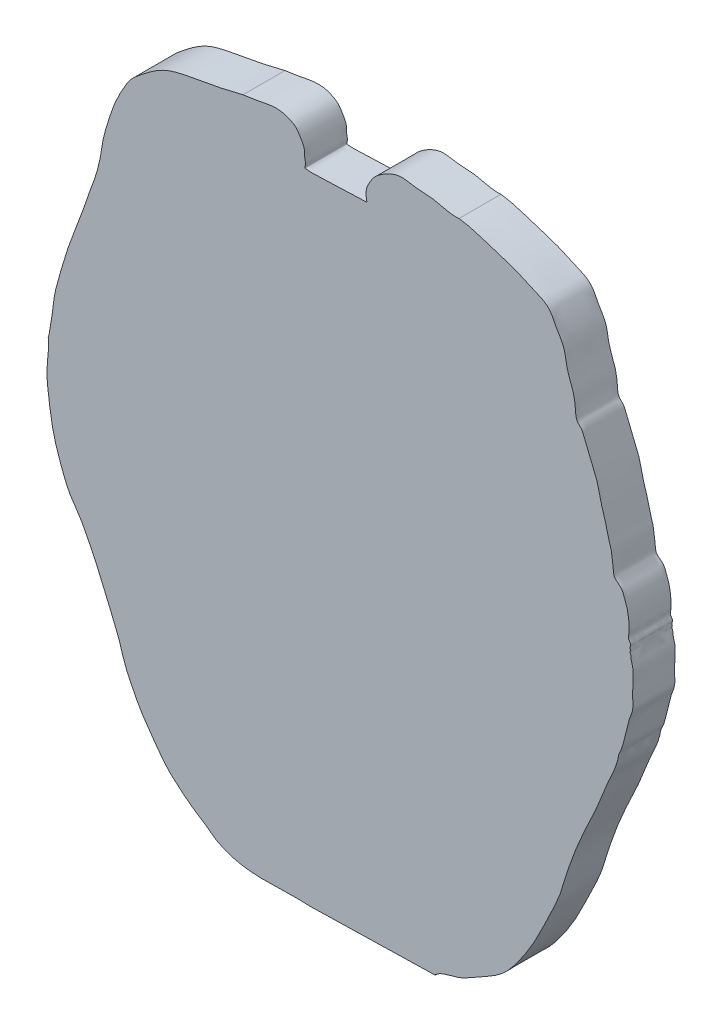
ISO-10303-21;
HEADER;
FILE_DESCRIPTION(('STEP AP214'),'2;1');
FILE_NAME('part.step','',(''),(''),'','','');
FILE_SCHEMA(('AUTOMOTIVE_DESIGN { 1 0 10303 214 1 1 1 1 }'));
ENDSEC;
DATA;
#1=APPLICATION_CONTEXT('core data for automotive mechanical design processes');
#2=APPLICATION_PROTOCOL_DEFINITION('international standard','automotive_design',2000,#1);
#3=PRODUCT_CONTEXT('',#1,'mechanical');
#4=PRODUCT('Part','Part','',(#3));
#5=PRODUCT_RELATED_PRODUCT_CATEGORY('part','',(#4));
#6=PRODUCT_DEFINITION_FORMATION('','',#4);
#7=PRODUCT_DEFINITION_CONTEXT('part definition',#1,'design');
#8=PRODUCT_DEFINITION('design','',#6,#7);
#9=PRODUCT_DEFINITION_SHAPE('','',#8);
#10=(LENGTH_UNIT() NAMED_UNIT(*) SI_UNIT(.MILLI.,.METRE.));
#11=(NAMED_UNIT(*) PLANE_ANGLE_UNIT() SI_UNIT($,.RADIAN.));
#12=(NAMED_UNIT(*) SI_UNIT($,.STERADIAN.) SOLID_ANGLE_UNIT());
#13=UNCERTAINTY_MEASURE_WITH_UNIT(LENGTH_MEASURE(1.E-05),#10,'distance_accuracy_value','');
#14=(GEOMETRIC_REPRESENTATION_CONTEXT(3) GLOBAL_UNCERTAINTY_ASSIGNED_CONTEXT((#13)) GLOBAL_UNIT_ASSIGNED_CONTEXT((#10,
#11,#12)) REPRESENTATION_CONTEXT('',''));
#15=CARTESIAN_POINT('',(0.,0.,0.));
#16=DIRECTION('',(0.,0.,1.));
#17=DIRECTION('',(1.,0.,0.));
#18=AXIS2_PLACEMENT_3D('',#15,#16,#17);
#19=CARTESIAN_POINT('',(-1067.80244217999,-595.323122818989,100.));
#20=CARTESIAN_POINT('',(-997.118302992686,-634.980800497117,100.));
#21=CARTESIAN_POINT('',(-919.007086081671,-615.388320093955,100.));
#22=CARTESIAN_POINT('',(-843.99446333732,-620.515143976318,100.));
#23=B_SPLINE_CURVE_WITH_KNOTS('',3,(#19,#20,#21,#22),.UNSPECIFIED.,.F.,.F.,(4,4),(0.,1.),.UNSPECIFIED.);
#24=DIRECTION('',(0.,0.,-1.));
#25=VECTOR('',#24,1.);
#26=SURFACE_OF_LINEAR_EXTRUSION('',#23,#25);
#27=CARTESIAN_POINT('',(-1067.80244217999,-595.323122818989,0.));
#28=CARTESIAN_POINT('',(-997.118302992686,-634.980800497117,0.));
#29=CARTESIAN_POINT('',(-919.007086081671,-615.388320093955,0.));
#30=CARTESIAN_POINT('',(-843.99446333732,-620.515143976318,0.));
#31=B_SPLINE_CURVE_WITH_KNOTS('',3,(#27,#28,#29,#30),.UNSPECIFIED.,.F.,.F.,(4,4),(0.,1.),.UNSPECIFIED.);
#32=CARTESIAN_POINT('',(-1067.80244217999,-595.323122818989,0.));
#33=VERTEX_POINT('',#32);
#34=CARTESIAN_POINT('',(-843.99446333732,-620.515143976318,0.));
#35=VERTEX_POINT('',#34);
#36=EDGE_CURVE('E220',#33,#35,#31,.T.);
#37=ORIENTED_EDGE('',*,*,#36,.T.);
#38=DIRECTION('',(0.,0.,-1.));
#39=VECTOR('',#38,1.);
#40=CARTESIAN_POINT('',(-843.99446333732,-620.515143976318,100.));
#41=LINE('',#40,#39);
#42=CARTESIAN_POINT('',(-843.99446333732,-620.515143976318,100.));
#43=VERTEX_POINT('',#42);
#44=EDGE_CURVE('E11',#43,#35,#41,.T.);
#45=ORIENTED_EDGE('',*,*,#44,.F.);
#46=CARTESIAN_POINT('',(-1067.80244217999,-595.323122818989,100.));
#47=VERTEX_POINT('',#46);
#48=EDGE_CURVE('E93',#47,#43,#23,.T.);
#49=ORIENTED_EDGE('',*,*,#48,.F.);
#50=DIRECTION('',(0.,0.,-1.));
#51=VECTOR('',#50,1.);
#52=CARTESIAN_POINT('',(-1067.80244217999,-595.323122818989,100.));
#53=LINE('',#52,#51);
#54=EDGE_CURVE('E56',#47,#33,#53,.T.);
#55=ORIENTED_EDGE('',*,*,#54,.T.);
#56=EDGE_LOOP('',(#37,#45,#49,#55));
#57=FACE_BOUND('',#56,.T.);
#58=ADVANCED_FACE('F39',(#57),#26,.F.);
#59=CARTESIAN_POINT('',(-544.99446333732,-613.515143976318,100.));
#60=DIRECTION('',(0.0234049580773987,-0.999726066448902,0.));
#61=DIRECTION('',(0.999726066448902,0.0234049580773987,0.));
#62=AXIS2_PLACEMENT_3D('',#59,#60,#61);
#63=PLANE('',#62);
#64=DIRECTION('',(-0.999726066448902,-0.0234049580773987,0.));
#65=VECTOR('',#64,1.);
#66=CARTESIAN_POINT('',(-544.99446333732,-613.515143976318,0.));
#67=LINE('',#66,#65);
#68=CARTESIAN_POINT('',(-544.99446333732,-613.515143976318,0.));
#69=VERTEX_POINT('',#68);
#70=EDGE_CURVE('E218',#69,#35,#67,.T.);
#71=ORIENTED_EDGE('',*,*,#70,.F.);
#72=DIRECTION('',(0.,0.,-1.));
#73=VECTOR('',#72,1.);
#74=CARTESIAN_POINT('',(-544.99446333732,-613.515143976318,100.));
#75=LINE('',#74,#73);
#76=CARTESIAN_POINT('',(-544.99446333732,-613.515143976318,100.));
#77=VERTEX_POINT('',#76);
#78=EDGE_CURVE('E48',#77,#69,#75,.T.);
#79=ORIENTED_EDGE('',*,*,#78,.F.);
#80=DIRECTION('',(-0.999726066448902,-0.0234049580773987,0.));
#81=VECTOR('',#80,1.);
#82=CARTESIAN_POINT('',(-544.99446333732,-613.515143976318,100.));
#83=LINE('',#82,#81);
#84=EDGE_CURVE('E179',#77,#43,#83,.T.);
#85=ORIENTED_EDGE('',*,*,#84,.T.);
#86=ORIENTED_EDGE('',*,*,#44,.T.);
#87=EDGE_LOOP('',(#71,#79,#85,#86));
#88=FACE_BOUND('',#87,.T.);
#89=ADVANCED_FACE('F219',(#88),#63,.T.);
#90=CARTESIAN_POINT('',(-544.99446333732,-612.515143976318,100.));
#91=DIRECTION('',(1.,0.,0.));
#92=DIRECTION('',(0.,0.,-1.));
#93=AXIS2_PLACEMENT_3D('',#90,#91,#92);
#94=PLANE('',#93);
#95=DIRECTION('',(0.,-1.,0.));
#96=VECTOR('',#95,1.);
#97=CARTESIAN_POINT('',(-544.99446333732,-612.515143976318,0.));
#98=LINE('',#97,#96);
#99=CARTESIAN_POINT('',(-544.99446333732,-612.515143976318,0.));
#100=VERTEX_POINT('',#99);
#101=EDGE_CURVE('E213',#100,#69,#98,.T.);
#102=ORIENTED_EDGE('',*,*,#101,.F.);
#103=DIRECTION('',(0.,0.,-1.));
#104=VECTOR('',#103,1.);
#105=CARTESIAN_POINT('',(-544.99446333732,-612.515143976318,100.));
#106=LINE('',#105,#104);
#107=CARTESIAN_POINT('',(-544.99446333732,-612.515143976318,100.));
#108=VERTEX_POINT('',#107);
#109=EDGE_CURVE('E207',#108,#100,#106,.T.);
#110=ORIENTED_EDGE('',*,*,#109,.F.);
#111=DIRECTION('',(0.,-1.,0.));
#112=VECTOR('',#111,1.);
#113=CARTESIAN_POINT('',(-544.99446333732,-612.515143976318,100.));
#114=LINE('',#113,#112);
#115=EDGE_CURVE('E173',#108,#77,#114,.T.);
#116=ORIENTED_EDGE('',*,*,#115,.T.);
#117=ORIENTED_EDGE('',*,*,#78,.T.);
#118=EDGE_LOOP('',(#102,#110,#116,#117));
#119=FACE_BOUND('',#118,.T.);
#120=ADVANCED_FACE('F211',(#119),#94,.T.);
#121=CARTESIAN_POINT('',(-488.174265843598,977.704076621266,100.));
#122=CARTESIAN_POINT('',(-456.27669842423,973.772819568264,100.));
#123=CARTESIAN_POINT('',(-413.082050901761,956.001393340243,100.));
#124=CARTESIAN_POINT('',(-352.88053777627,940.042979017114,100.));
#125=CARTESIAN_POINT('',(-315.670408772491,920.096845698454,100.));
#126=CARTESIAN_POINT('',(-282.638450263019,909.115656445168,100.));
#127=CARTESIAN_POINT('',(-266.103267678689,889.158083790079,100.));
#128=CARTESIAN_POINT('',(-255.626909848488,864.830458521624,100.));
#129=CARTESIAN_POINT('',(-234.906704645958,837.488931337633,100.));
#130=CARTESIAN_POINT('',(-232.912182322015,797.596000168427,100.));
#131=CARTESIAN_POINT('',(-216.805122626724,762.645190053665,100.));
#132=CARTESIAN_POINT('',(-210.051739344062,729.655910291816,100.));
#133=CARTESIAN_POINT('',(-210.48683472108,699.650404741302,100.));
#134=CARTESIAN_POINT('',(-195.473367160149,689.870798640654,100.));
#135=CARTESIAN_POINT('',(-190.356917308427,675.569305079209,100.));
#136=CARTESIAN_POINT('',(-183.236172500652,660.113219275418,100.));
#137=CARTESIAN_POINT('',(-175.670732080578,641.069479696946,100.));
#138=CARTESIAN_POINT('',(-169.301082891948,624.944272330599,100.));
#139=CARTESIAN_POINT('',(-160.940778666841,606.918509189212,100.));
#140=CARTESIAN_POINT('',(-155.220160250621,586.954996914519,100.));
#141=CARTESIAN_POINT('',(-150.771527302008,563.520719903201,100.));
#142=CARTESIAN_POINT('',(-144.526324465802,542.958930791993,100.));
#143=CARTESIAN_POINT('',(-137.322376344794,520.688253704635,100.));
#144=CARTESIAN_POINT('',(-133.492446010414,498.07241121497,100.));
#145=CARTESIAN_POINT('',(-124.168210292981,475.49511544781,100.));
#146=CARTESIAN_POINT('',(-123.593395618875,456.007770616522,100.));
#147=CARTESIAN_POINT('',(-119.600202311964,438.31578058616,100.));
#148=CARTESIAN_POINT('',(-120.67770147664,423.113128801113,100.));
#149=CARTESIAN_POINT('',(-108.96382765925,414.077110511738,100.));
#150=CARTESIAN_POINT('',(-99.4283142746941,406.758279522538,100.));
#151=CARTESIAN_POINT('',(-95.0923061044222,394.959107278975,100.));
#152=CARTESIAN_POINT('',(-90.6927061242956,383.673283845476,100.));
#153=CARTESIAN_POINT('',(-86.9680342695029,372.644834332399,100.));
#154=CARTESIAN_POINT('',(-85.0294137033156,361.089359505023,100.));
#155=CARTESIAN_POINT('',(-83.0675792225179,348.96060619307,100.));
#156=CARTESIAN_POINT('',(-83.1328333630723,337.646119685937,100.));
#157=CARTESIAN_POINT('',(-81.4046748803664,324.462048367177,100.));
#158=CARTESIAN_POINT('',(-87.1355160715851,311.967656037185,100.));
#159=CARTESIAN_POINT('',(-77.0075289452424,302.896484143079,100.));
#160=CARTESIAN_POINT('',(-81.4511755585683,296.340032763018,100.));
#161=CARTESIAN_POINT('',(-78.9922922552459,290.912569240715,100.));
#162=CARTESIAN_POINT('',(-81.1248450364348,285.382673090059,100.));
#163=CARTESIAN_POINT('',(-77.8509595576318,280.395040720108,100.));
#164=CARTESIAN_POINT('',(-78.2827920334625,272.538915116393,100.));
#165=CARTESIAN_POINT('',(-75.6949430868123,264.142711362777,100.));
#166=CARTESIAN_POINT('',(-72.8991335284579,253.136627469019,100.));
#167=CARTESIAN_POINT('',(-73.3456039791067,242.437648975268,100.));
#168=CARTESIAN_POINT('',(-72.9360697435838,230.519188130367,100.));
#169=CARTESIAN_POINT('',(-74.2578776331057,218.8955078796,100.));
#170=CARTESIAN_POINT('',(-73.6736192913409,207.232098076885,100.));
#171=CARTESIAN_POINT('',(-74.8004356424112,194.066808289263,100.));
#172=CARTESIAN_POINT('',(-72.6711275018345,179.444613631175,100.));
#173=CARTESIAN_POINT('',(-75.2936155752254,163.050653013267,100.));
#174=CARTESIAN_POINT('',(-81.8809330584591,149.176288447222,100.));
#175=CARTESIAN_POINT('',(-87.2228903750647,126.097374784738,100.));
#176=CARTESIAN_POINT('',(-93.8043306644634,101.137095726614,100.));
#177=CARTESIAN_POINT('',(-100.061347868966,75.1626308217554,100.));
#178=CARTESIAN_POINT('',(-107.882675617774,61.8619277686332,100.));
#179=CARTESIAN_POINT('',(-108.797051732633,51.7138459543968,100.));
#180=CARTESIAN_POINT('',(-111.518705333155,42.3424245704491,100.));
#181=CARTESIAN_POINT('',(-115.227974272958,30.3905840414519,100.));
#182=CARTESIAN_POINT('',(-120.928179416441,16.5564058371068,100.));
#183=CARTESIAN_POINT('',(-131.704513669928,-4.95594493607238,100.));
#184=CARTESIAN_POINT('',(-143.438372488137,-34.3116614398319,100.));
#185=CARTESIAN_POINT('',(-156.513526554184,-68.9344318106463,100.));
#186=CARTESIAN_POINT('',(-182.156502861408,-121.832398253302,100.));
#187=CARTESIAN_POINT('',(-208.666788718586,-180.182076413997,100.));
#188=CARTESIAN_POINT('',(-232.243947306382,-246.785558045376,100.));
#189=CARTESIAN_POINT('',(-247.285167826548,-303.40438887812,100.));
#190=CARTESIAN_POINT('',(-277.412086588044,-362.677807945163,100.));
#191=CARTESIAN_POINT('',(-308.293520213188,-429.725258745992,100.));
#192=CARTESIAN_POINT('',(-344.845724501859,-485.405793139292,100.));
#193=CARTESIAN_POINT('',(-387.316242530799,-537.89931160031,100.));
#194=CARTESIAN_POINT('',(-439.781729375868,-562.908683044637,100.));
#195=CARTESIAN_POINT('',(-491.433435634681,-596.200471511563,100.));
#196=CARTESIAN_POINT('',(-528.778610805469,-598.00602179097,100.));
#197=CARTESIAN_POINT('',(-544.99446333732,-612.515143976318,100.));
#198=B_SPLINE_CURVE_WITH_KNOTS('',3,(#121,#122,#123,#124,#125,#126,#127,#128,#129,#130,#131,
#132,#133,#134,#135,#136,#137,#138,#139,#140,#141,#142,#143,#144,#145,#146,#147,#148,#149,#150,
#151,#152,#153,#154,#155,#156,#157,#158,#159,#160,#161,#162,#163,#164,#165,#166,#167,#168,#169,
#170,#171,#172,#173,#174,#175,#176,#177,#178,#179,#180,#181,#182,#183,#184,#185,#186,#187,#188,
#189,#190,#191,#192,#193,#194,#195,#196,#197),.UNSPECIFIED.,.F.,.F.,(4,1,1,1,1,1,1,1,1,1,1,1,1,
1,1,1,1,1,1,1,1,1,1,1,1,1,1,1,1,1,1,1,1,1,1,1,1,1,1,1,1,1,1,1,1,1,1,1,1,1,1,1,1,1,1,1,1,1,1,1,1,
1,1,1,1,1,1,1,1,1,1,1,1,1,4),(0.,0.0487565923174693,0.0717740076150183,0.0951282074120693,
0.113854206556252,0.123637851493577,0.133836302474475,0.154629530628376,0.174655872310598,
0.193344689420484,0.212906432065382,0.227665298096991,0.23466203220888,0.238295875809683,
0.250640501682434,0.260992336680103,0.2697302268583,0.277296236427207,0.291500076767327,
0.301482272660655,0.313949681868399,0.324487113399214,0.337427683535818,0.349074149127578,
0.361675335401456,0.366816306119553,0.377335959183094,0.382346671896455,0.388579815754073,
0.395601080675348,0.401011611451365,0.40735118273841,0.413396259177422,0.419000859256883,
0.426212669044611,0.430693541913193,0.439508538492858,0.444217573347864,0.447375039253077,
0.449630471098311,0.452774199483472,0.455622725910328,0.458079221744874,0.464619332375841,
0.469002916520732,0.475463559797263,0.480927294068268,0.487344124544246,0.493373072705355,
0.498840054367,0.507587331932363,0.515914369111881,0.52389875801894,0.531062190076001,
0.552208527688787,0.563671456317942,0.57200294641089,0.575321816029739,0.579188001516207,
0.586976444935862,0.594554468263094,0.602147983877299,0.623945165960762,0.643092521222332,
0.658999667745778,0.714253082619193,0.741476833466143,0.767541856559676,0.804019747524885,
0.843270654931543,0.880836483504115,0.906434173187082,0.94557419487601,0.968646856688553,1.),.UNSPECIFIED.);
#199=DIRECTION('',(0.,0.,-1.));
#200=VECTOR('',#199,1.);
#201=SURFACE_OF_LINEAR_EXTRUSION('',#198,#200);
#202=CARTESIAN_POINT('',(-488.174265843598,977.704076621266,0.));
#203=CARTESIAN_POINT('',(-456.27669842423,973.772819568264,0.));
#204=CARTESIAN_POINT('',(-413.082050901761,956.001393340243,0.));
#205=CARTESIAN_POINT('',(-352.88053777627,940.042979017114,0.));
#206=CARTESIAN_POINT('',(-315.670408772491,920.096845698454,0.));
#207=CARTESIAN_POINT('',(-282.638450263019,909.115656445168,0.));
#208=CARTESIAN_POINT('',(-266.103267678689,889.158083790079,0.));
#209=CARTESIAN_POINT('',(-255.626909848488,864.830458521624,0.));
#210=CARTESIAN_POINT('',(-234.906704645958,837.488931337633,0.));
#211=CARTESIAN_POINT('',(-232.912182322015,797.596000168427,0.));
#212=CARTESIAN_POINT('',(-216.805122626724,762.645190053665,0.));
#213=CARTESIAN_POINT('',(-210.051739344062,729.655910291816,0.));
#214=CARTESIAN_POINT('',(-210.48683472108,699.650404741302,0.));
#215=CARTESIAN_POINT('',(-195.473367160149,689.870798640654,0.));
#216=CARTESIAN_POINT('',(-190.356917308427,675.569305079209,0.));
#217=CARTESIAN_POINT('',(-183.236172500652,660.113219275418,0.));
#218=CARTESIAN_POINT('',(-175.670732080578,641.069479696946,0.));
#219=CARTESIAN_POINT('',(-169.301082891948,624.944272330599,0.));
#220=CARTESIAN_POINT('',(-160.940778666841,606.918509189212,0.));
#221=CARTESIAN_POINT('',(-155.220160250621,586.954996914519,0.));
#222=CARTESIAN_POINT('',(-150.771527302008,563.520719903201,0.));
#223=CARTESIAN_POINT('',(-144.526324465802,542.958930791993,0.));
#224=CARTESIAN_POINT('',(-137.322376344794,520.688253704635,0.));
#225=CARTESIAN_POINT('',(-133.492446010414,498.07241121497,0.));
#226=CARTESIAN_POINT('',(-124.168210292981,475.49511544781,0.));
#227=CARTESIAN_POINT('',(-123.593395618875,456.007770616522,0.));
#228=CARTESIAN_POINT('',(-119.600202311964,438.31578058616,0.));
#229=CARTESIAN_POINT('',(-120.67770147664,423.113128801113,0.));
#230=CARTESIAN_POINT('',(-108.96382765925,414.077110511738,0.));
#231=CARTESIAN_POINT('',(-99.4283142746941,406.758279522538,0.));
#232=CARTESIAN_POINT('',(-95.0923061044222,394.959107278975,0.));
#233=CARTESIAN_POINT('',(-90.6927061242956,383.673283845476,0.));
#234=CARTESIAN_POINT('',(-86.9680342695029,372.644834332399,0.));
#235=CARTESIAN_POINT('',(-85.0294137033156,361.089359505023,0.));
#236=CARTESIAN_POINT('',(-83.0675792225179,348.96060619307,0.));
#237=CARTESIAN_POINT('',(-83.1328333630723,337.646119685937,0.));
#238=CARTESIAN_POINT('',(-81.4046748803664,324.462048367177,0.));
#239=CARTESIAN_POINT('',(-87.1355160715851,311.967656037185,0.));
#240=CARTESIAN_POINT('',(-77.0075289452424,302.896484143079,0.));
#241=CARTESIAN_POINT('',(-81.4511755585683,296.340032763018,0.));
#242=CARTESIAN_POINT('',(-78.9922922552459,290.912569240715,0.));
#243=CARTESIAN_POINT('',(-81.1248450364348,285.382673090059,0.));
#244=CARTESIAN_POINT('',(-77.8509595576318,280.395040720108,0.));
#245=CARTESIAN_POINT('',(-78.2827920334625,272.538915116393,0.));
#246=CARTESIAN_POINT('',(-75.6949430868123,264.142711362777,0.));
#247=CARTESIAN_POINT('',(-72.8991335284579,253.136627469019,0.));
#248=CARTESIAN_POINT('',(-73.3456039791067,242.437648975268,0.));
#249=CARTESIAN_POINT('',(-72.9360697435838,230.519188130367,0.));
#250=CARTESIAN_POINT('',(-74.2578776331057,218.8955078796,0.));
#251=CARTESIAN_POINT('',(-73.6736192913409,207.232098076885,0.));
#252=CARTESIAN_POINT('',(-74.8004356424112,194.066808289263,0.));
#253=CARTESIAN_POINT('',(-72.6711275018345,179.444613631175,0.));
#254=CARTESIAN_POINT('',(-75.2936155752254,163.050653013267,0.));
#255=CARTESIAN_POINT('',(-81.8809330584591,149.176288447222,0.));
#256=CARTESIAN_POINT('',(-87.2228903750647,126.097374784738,0.));
#257=CARTESIAN_POINT('',(-93.8043306644634,101.137095726614,0.));
#258=CARTESIAN_POINT('',(-100.061347868966,75.1626308217554,0.));
#259=CARTESIAN_POINT('',(-107.882675617774,61.8619277686332,0.));
#260=CARTESIAN_POINT('',(-108.797051732633,51.7138459543968,0.));
#261=CARTESIAN_POINT('',(-111.518705333155,42.3424245704491,0.));
#262=CARTESIAN_POINT('',(-115.227974272958,30.3905840414519,0.));
#263=CARTESIAN_POINT('',(-120.928179416441,16.5564058371068,0.));
#264=CARTESIAN_POINT('',(-131.704513669928,-4.95594493607238,0.));
#265=CARTESIAN_POINT('',(-143.438372488137,-34.3116614398319,0.));
#266=CARTESIAN_POINT('',(-156.513526554184,-68.9344318106463,0.));
#267=CARTESIAN_POINT('',(-182.156502861408,-121.832398253302,0.));
#268=CARTESIAN_POINT('',(-208.666788718586,-180.182076413997,0.));
#269=CARTESIAN_POINT('',(-232.243947306382,-246.785558045376,0.));
#270=CARTESIAN_POINT('',(-247.285167826548,-303.40438887812,0.));
#271=CARTESIAN_POINT('',(-277.412086588044,-362.677807945163,0.));
#272=CARTESIAN_POINT('',(-308.293520213188,-429.725258745992,0.));
#273=CARTESIAN_POINT('',(-344.845724501859,-485.405793139292,0.));
#274=CARTESIAN_POINT('',(-387.316242530799,-537.89931160031,0.));
#275=CARTESIAN_POINT('',(-439.781729375868,-562.908683044637,0.));
#276=CARTESIAN_POINT('',(-491.433435634681,-596.200471511563,0.));
#277=CARTESIAN_POINT('',(-528.778610805469,-598.00602179097,0.));
#278=CARTESIAN_POINT('',(-544.99446333732,-612.515143976318,0.));
#279=B_SPLINE_CURVE_WITH_KNOTS('',3,(#202,#203,#204,#205,#206,#207,#208,#209,#210,#211,#212,
#213,#214,#215,#216,#217,#218,#219,#220,#221,#222,#223,#224,#225,#226,#227,#228,#229,#230,#231,
#232,#233,#234,#235,#236,#237,#238,#239,#240,#241,#242,#243,#244,#245,#246,#247,#248,#249,#250,
#251,#252,#253,#254,#255,#256,#257,#258,#259,#260,#261,#262,#263,#264,#265,#266,#267,#268,#269,
#270,#271,#272,#273,#274,#275,#276,#277,#278),.UNSPECIFIED.,.F.,.F.,(4,1,1,1,1,1,1,1,1,1,1,1,1,
1,1,1,1,1,1,1,1,1,1,1,1,1,1,1,1,1,1,1,1,1,1,1,1,1,1,1,1,1,1,1,1,1,1,1,1,1,1,1,1,1,1,1,1,1,1,1,1,
1,1,1,1,1,1,1,1,1,1,1,1,1,4),(0.,0.0487565923174693,0.0717740076150183,0.0951282074120693,
0.113854206556252,0.123637851493577,0.133836302474475,0.154629530628376,0.174655872310598,
0.193344689420484,0.212906432065382,0.227665298096991,0.23466203220888,0.238295875809683,
0.250640501682434,0.260992336680103,0.2697302268583,0.277296236427207,0.291500076767327,
0.301482272660655,0.313949681868399,0.324487113399214,0.337427683535818,0.349074149127578,
0.361675335401456,0.366816306119553,0.377335959183094,0.382346671896455,0.388579815754073,
0.395601080675348,0.401011611451365,0.40735118273841,0.413396259177422,0.419000859256883,
0.426212669044611,0.430693541913193,0.439508538492858,0.444217573347864,0.447375039253077,
0.449630471098311,0.452774199483472,0.455622725910328,0.458079221744874,0.464619332375841,
0.469002916520732,0.475463559797263,0.480927294068268,0.487344124544246,0.493373072705355,
0.498840054367,0.507587331932363,0.515914369111881,0.52389875801894,0.531062190076001,
0.552208527688787,0.563671456317942,0.57200294641089,0.575321816029739,0.579188001516207,
0.586976444935862,0.594554468263094,0.602147983877299,0.623945165960762,0.643092521222332,
0.658999667745778,0.714253082619193,0.741476833466143,0.767541856559676,0.804019747524885,
0.843270654931543,0.880836483504115,0.906434173187082,0.94557419487601,0.968646856688553,1.),.UNSPECIFIED.);
#280=CARTESIAN_POINT('',(-488.174265843598,977.704076621266,0.));
#281=VERTEX_POINT('',#280);
#282=EDGE_CURVE('E225',#281,#100,#279,.T.);
#283=ORIENTED_EDGE('',*,*,#282,.F.);
#284=DIRECTION('',(0.,0.,-1.));
#285=VECTOR('',#284,1.);
#286=CARTESIAN_POINT('',(-488.174265843598,977.704076621266,100.));
#287=LINE('',#286,#285);
#288=CARTESIAN_POINT('',(-488.174265843598,977.704076621266,100.));
#289=VERTEX_POINT('',#288);
#290=EDGE_CURVE('E205',#289,#281,#287,.T.);
#291=ORIENTED_EDGE('',*,*,#290,.F.);
#292=EDGE_CURVE('E164',#289,#108,#198,.T.);
#293=ORIENTED_EDGE('',*,*,#292,.T.);
#294=ORIENTED_EDGE('',*,*,#109,.T.);
#295=EDGE_LOOP('',(#283,#291,#293,#294));
#296=FACE_BOUND('',#295,.T.);
#297=ADVANCED_FACE('F157',(#296),#201,.T.);
#298=CARTESIAN_POINT('',(-709.99446333732,914.484856023682,100.));
#299=CARTESIAN_POINT('',(-710.025141677251,928.111294218663,100.));
#300=CARTESIAN_POINT('',(-706.556524679254,936.469765177445,100.));
#301=CARTESIAN_POINT('',(-693.357896774898,960.709928189372,100.));
#302=CARTESIAN_POINT('',(-674.711163852387,975.882524791437,100.));
#303=CARTESIAN_POINT('',(-653.069107275058,988.272371826373,100.));
#304=CARTESIAN_POINT('',(-626.361572184654,997.152418105936,100.));
#305=CARTESIAN_POINT('',(-592.838906392304,988.511952990885,100.));
#306=CARTESIAN_POINT('',(-545.459079883726,990.015587365046,100.));
#307=CARTESIAN_POINT('',(-510.675866400456,975.288933631276,100.));
#308=CARTESIAN_POINT('',(-488.174265843598,977.704076621266,100.));
#309=B_SPLINE_CURVE_WITH_KNOTS('',3,(#298,#299,#300,#301,#302,#303,#304,#305,#306,#307,#308),
.UNSPECIFIED.,.F.,.F.,(4,1,1,1,1,1,1,1,4),(0.,0.0926560028468117,0.183249979274173,
0.27776229883076,0.368010183865593,0.46533523532728,0.586986070104497,0.749779645410437,1.),.UNSPECIFIED.);
#310=DIRECTION('',(0.,0.,-1.));
#311=VECTOR('',#310,1.);
#312=SURFACE_OF_LINEAR_EXTRUSION('',#309,#311);
#313=CARTESIAN_POINT('',(-709.99446333732,914.484856023682,0.));
#314=CARTESIAN_POINT('',(-710.025141677251,928.111294218663,0.));
#315=CARTESIAN_POINT('',(-706.556524679254,936.469765177445,0.));
#316=CARTESIAN_POINT('',(-693.357896774898,960.709928189372,0.));
#317=CARTESIAN_POINT('',(-674.711163852387,975.882524791437,0.));
#318=CARTESIAN_POINT('',(-653.069107275058,988.272371826373,0.));
#319=CARTESIAN_POINT('',(-626.361572184654,997.152418105936,0.));
#320=CARTESIAN_POINT('',(-592.838906392304,988.511952990885,0.));
#321=CARTESIAN_POINT('',(-545.459079883726,990.015587365046,0.));
#322=CARTESIAN_POINT('',(-510.675866400456,975.288933631276,0.));
#323=CARTESIAN_POINT('',(-488.174265843598,977.704076621266,0.));
#324=B_SPLINE_CURVE_WITH_KNOTS('',3,(#313,#314,#315,#316,#317,#318,#319,#320,#321,#322,#323),
.UNSPECIFIED.,.F.,.F.,(4,1,1,1,1,1,1,1,4),(0.,0.0926560028468117,0.183249979274173,
0.27776229883076,0.368010183865593,0.46533523532728,0.586986070104497,0.749779645410437,1.),.UNSPECIFIED.);
#325=CARTESIAN_POINT('',(-709.99446333732,914.484856023682,0.));
#326=VERTEX_POINT('',#325);
#327=EDGE_CURVE('E227',#326,#281,#324,.T.);
#328=ORIENTED_EDGE('',*,*,#327,.F.);
#329=DIRECTION('',(0.,0.,-1.));
#330=VECTOR('',#329,1.);
#331=CARTESIAN_POINT('',(-709.99446333732,914.484856023682,100.));
#332=LINE('',#331,#330);
#333=CARTESIAN_POINT('',(-709.99446333732,914.484856023682,100.));
#334=VERTEX_POINT('',#333);
#335=EDGE_CURVE('E127',#334,#326,#332,.T.);
#336=ORIENTED_EDGE('',*,*,#335,.F.);
#337=EDGE_CURVE('E117',#334,#289,#309,.T.);
#338=ORIENTED_EDGE('',*,*,#337,.T.);
#339=ORIENTED_EDGE('',*,*,#290,.T.);
#340=EDGE_LOOP('',(#328,#336,#338,#339));
#341=FACE_BOUND('',#340,.T.);
#342=ADVANCED_FACE('F154',(#341),#312,.T.);
#343=CARTESIAN_POINT('',(-709.99446333732,914.484856023682,100.));
#344=DIRECTION('',(0.988227740953987,0.15298997355703,0.));
#345=DIRECTION('',(-0.15298997355703,0.988227740953987,0.));
#346=AXIS2_PLACEMENT_3D('',#343,#344,#345);
#347=PLANE('',#346);
#348=CARTESIAN_POINT('',(-709.99446333732,914.484856023682,0.));
#349=CARTESIAN_POINT('',(-707.961414352682,901.352522194045,0.));
#350=B_SPLINE_CURVE_WITH_KNOTS('',1,(#348,#349),.UNSPECIFIED.,.F.,.F.,(2,2),(0.,1.),.UNSPECIFIED.);
#351=CARTESIAN_POINT('',(-707.961414352682,901.352522194045,0.));
#352=VERTEX_POINT('',#351);
#353=EDGE_CURVE('E124',#326,#352,#350,.T.);
#354=ORIENTED_EDGE('',*,*,#353,.T.);
#355=DIRECTION('',(0.,0.,-1.));
#356=VECTOR('',#355,1.);
#357=CARTESIAN_POINT('',(-707.961414352682,901.352522194045,100.));
#358=LINE('',#357,#356);
#359=CARTESIAN_POINT('',(-707.961414352682,901.352522194045,100.));
#360=VERTEX_POINT('',#359);
#361=EDGE_CURVE('E121',#360,#352,#358,.T.);
#362=ORIENTED_EDGE('',*,*,#361,.F.);
#363=CARTESIAN_POINT('',(-709.99446333732,914.484856023682,100.));
#364=CARTESIAN_POINT('',(-707.961414352682,901.352522194045,100.));
#365=B_SPLINE_CURVE_WITH_KNOTS('',1,(#363,#364),.UNSPECIFIED.,.F.,.F.,(2,2),(0.,1.),.UNSPECIFIED.);
#366=EDGE_CURVE('E110',#334,#360,#365,.T.);
#367=ORIENTED_EDGE('',*,*,#366,.F.);
#368=ORIENTED_EDGE('',*,*,#335,.T.);
#369=EDGE_LOOP('',(#354,#362,#367,#368));
#370=FACE_BOUND('',#369,.T.);
#371=ADVANCED_FACE('F122',(#370),#347,.F.);
#372=CARTESIAN_POINT('',(-1003.3213462674,975.576997580112,100.));
#373=CARTESIAN_POINT('',(-987.625286886506,977.252933346961,100.));
#374=CARTESIAN_POINT('',(-962.704341777126,982.153446744202,100.));
#375=CARTESIAN_POINT('',(-930.107996088626,988.286600947492,100.));
#376=CARTESIAN_POINT('',(-907.733427820424,986.847160198954,100.));
#377=CARTESIAN_POINT('',(-890.506709848822,980.153836056436,100.));
#378=CARTESIAN_POINT('',(-877.228125332423,972.882171328597,100.));
#379=CARTESIAN_POINT('',(-868.657722364951,960.200996549027,100.));
#380=CARTESIAN_POINT('',(-862.567954839285,949.919049801685,100.));
#381=CARTESIAN_POINT('',(-857.650273693231,940.261982009231,100.));
#382=CARTESIAN_POINT('',(-856.650464799881,932.113160777843,100.));
#383=CARTESIAN_POINT('',(-856.858442050881,925.89237877557,100.));
#384=CARTESIAN_POINT('',(-856.484148596601,920.051139944616,100.));
#385=CARTESIAN_POINT('',(-854.999627019737,913.576766741436,100.));
#386=CARTESIAN_POINT('',(-853.8051958671,906.771565927989,100.));
#387=CARTESIAN_POINT('',(-856.891801947747,896.179933994825,100.));
#388=CARTESIAN_POINT('',(-849.532852724151,897.800494320589,100.));
#389=CARTESIAN_POINT('',(-844.301174530647,896.098862820463,100.));
#390=CARTESIAN_POINT('',(-836.051338892841,896.664214644749,100.));
#391=CARTESIAN_POINT('',(-824.382729299936,897.356086053915,100.));
#392=CARTESIAN_POINT('',(-811.091645754003,897.39899852468,100.));
#393=CARTESIAN_POINT('',(-771.658563619573,898.71200455024,100.));
#394=CARTESIAN_POINT('',(-737.566058228754,900.231134168436,100.));
#395=CARTESIAN_POINT('',(-707.961414352682,901.352522194045,100.));
#396=B_SPLINE_CURVE_WITH_KNOTS('',3,(#372,#373,#374,#375,#376,#377,#378,#379,#380,#381,#382,
#383,#384,#385,#386,#387,#388,#389,#390,#391,#392,#393,#394,#395),.UNSPECIFIED.,.F.,.F.,(4,1,1,
1,1,1,1,1,1,1,1,1,1,1,1,1,1,1,1,1,1,4),(0.,0.132408410489822,0.213689757302113,
0.278435216233325,0.316912047676386,0.369102621337167,0.401753186738869,0.443732499606216,
0.470308429454738,0.491738561062307,0.51185490976716,0.522604246314191,0.541061713556092,
0.565961939223553,0.58918954778618,0.600387476926508,0.616595682546797,0.637287508132187,
0.66800449851328,0.715727348997109,0.748605259200423,1.),.UNSPECIFIED.);
#397=DIRECTION('',(0.,0.,-1.));
#398=VECTOR('',#397,1.);
#399=SURFACE_OF_LINEAR_EXTRUSION('',#396,#398);
#400=CARTESIAN_POINT('',(-1003.3213462674,975.576997580112,0.));
#401=CARTESIAN_POINT('',(-987.625286886506,977.252933346961,0.));
#402=CARTESIAN_POINT('',(-962.704341777126,982.153446744202,0.));
#403=CARTESIAN_POINT('',(-930.107996088626,988.286600947492,0.));
#404=CARTESIAN_POINT('',(-907.733427820424,986.847160198954,0.));
#405=CARTESIAN_POINT('',(-890.506709848822,980.153836056436,0.));
#406=CARTESIAN_POINT('',(-877.228125332423,972.882171328597,0.));
#407=CARTESIAN_POINT('',(-868.657722364951,960.200996549027,0.));
#408=CARTESIAN_POINT('',(-862.567954839285,949.919049801685,0.));
#409=CARTESIAN_POINT('',(-857.650273693231,940.261982009231,0.));
#410=CARTESIAN_POINT('',(-856.650464799881,932.113160777843,0.));
#411=CARTESIAN_POINT('',(-856.858442050881,925.89237877557,0.));
#412=CARTESIAN_POINT('',(-856.484148596601,920.051139944616,0.));
#413=CARTESIAN_POINT('',(-854.999627019737,913.576766741436,0.));
#414=CARTESIAN_POINT('',(-853.8051958671,906.771565927989,0.));
#415=CARTESIAN_POINT('',(-856.891801947747,896.179933994825,0.));
#416=CARTESIAN_POINT('',(-849.532852724151,897.800494320589,0.));
#417=CARTESIAN_POINT('',(-844.301174530647,896.098862820463,0.));
#418=CARTESIAN_POINT('',(-836.051338892841,896.664214644749,0.));
#419=CARTESIAN_POINT('',(-824.382729299936,897.356086053915,0.));
#420=CARTESIAN_POINT('',(-811.091645754003,897.39899852468,0.));
#421=CARTESIAN_POINT('',(-771.658563619573,898.71200455024,0.));
#422=CARTESIAN_POINT('',(-737.566058228754,900.231134168436,0.));
#423=CARTESIAN_POINT('',(-707.961414352682,901.352522194045,0.));
#424=B_SPLINE_CURVE_WITH_KNOTS('',3,(#400,#401,#402,#403,#404,#405,#406,#407,#408,#409,#410,
#411,#412,#413,#414,#415,#416,#417,#418,#419,#420,#421,#422,#423),.UNSPECIFIED.,.F.,.F.,(4,1,1,
1,1,1,1,1,1,1,1,1,1,1,1,1,1,1,1,1,1,4),(0.,0.132408410489822,0.213689757302113,
0.278435216233325,0.316912047676386,0.369102621337167,0.401753186738869,0.443732499606216,
0.470308429454738,0.491738561062307,0.51185490976716,0.522604246314191,0.541061713556092,
0.565961939223553,0.58918954778618,0.600387476926508,0.616595682546797,0.637287508132187,
0.66800449851328,0.715727348997109,0.748605259200423,1.),.UNSPECIFIED.);
#425=CARTESIAN_POINT('',(-1003.3213462674,975.576997580112,0.));
#426=VERTEX_POINT('',#425);
#427=EDGE_CURVE('E189',#426,#352,#424,.T.);
#428=ORIENTED_EDGE('',*,*,#427,.F.);
#429=DIRECTION('',(0.,0.,-1.));
#430=VECTOR('',#429,1.);
#431=CARTESIAN_POINT('',(-1003.3213462674,975.576997580112,100.));
#432=LINE('',#431,#430);
#433=CARTESIAN_POINT('',(-1003.3213462674,975.576997580112,100.));
#434=VERTEX_POINT('',#433);
#435=EDGE_CURVE('E81',#434,#426,#432,.T.);
#436=ORIENTED_EDGE('',*,*,#435,.F.);
#437=EDGE_CURVE('E114',#434,#360,#396,.T.);
#438=ORIENTED_EDGE('',*,*,#437,.T.);
#439=ORIENTED_EDGE('',*,*,#361,.T.);
#440=EDGE_LOOP('',(#428,#436,#438,#439));
#441=FACE_BOUND('',#440,.T.);
#442=ADVANCED_FACE('F129',(#441),#399,.T.);
#443=CARTESIAN_POINT('',(-1067.80244217999,-595.323122818989,100.));
#444=CARTESIAN_POINT('',(-1086.84700922583,-579.729961904444,100.));
#445=CARTESIAN_POINT('',(-1119.97017481595,-561.224126278324,100.));
#446=CARTESIAN_POINT('',(-1156.03471916688,-531.3608250023,100.));
#447=CARTESIAN_POINT('',(-1179.13815038321,-511.221675605164,100.));
#448=CARTESIAN_POINT('',(-1196.31596694215,-490.961554628108,100.));
#449=CARTESIAN_POINT('',(-1213.21739823131,-467.461049471078,100.));
#450=CARTESIAN_POINT('',(-1232.3976494516,-440.899738497459,100.));
#451=CARTESIAN_POINT('',(-1252.44319365176,-410.675686140574,100.));
#452=CARTESIAN_POINT('',(-1269.172612691,-376.57297376507,100.));
#453=CARTESIAN_POINT('',(-1286.51451948447,-341.087093500685,100.));
#454=CARTESIAN_POINT('',(-1296.73865095271,-301.232376708571,100.));
#455=CARTESIAN_POINT('',(-1313.45591617711,-261.143197941549,100.));
#456=CARTESIAN_POINT('',(-1331.04183397639,-218.738871303314,100.));
#457=CARTESIAN_POINT('',(-1349.71041771403,-174.628391123769,100.));
#458=CARTESIAN_POINT('',(-1370.42695068586,-132.166188438613,100.));
#459=CARTESIAN_POINT('',(-1390.70163896725,-90.5737996881551,100.));
#460=CARTESIAN_POINT('',(-1419.13535697914,-54.8158915760525,100.));
#461=CARTESIAN_POINT('',(-1435.37048642652,-11.4701061080921,100.));
#462=CARTESIAN_POINT('',(-1451.76841117071,32.5024847448222,100.));
#463=CARTESIAN_POINT('',(-1461.46459392118,79.0974430360601,100.));
#464=CARTESIAN_POINT('',(-1467.24052032716,123.63804512204,100.));
#465=CARTESIAN_POINT('',(-1472.38485080707,165.299163162444,100.));
#466=CARTESIAN_POINT('',(-1468.82735468648,202.626831231734,100.));
#467=CARTESIAN_POINT('',(-1466.13804919716,228.429338433525,100.));
#468=CARTESIAN_POINT('',(-1468.26756590047,242.799904931423,100.));
#469=CARTESIAN_POINT('',(-1465.75398326622,248.150925961077,100.));
#470=CARTESIAN_POINT('',(-1464.41378905918,264.200956181264,100.));
#471=CARTESIAN_POINT('',(-1457.61516020684,293.619534203526,100.));
#472=CARTESIAN_POINT('',(-1454.39758417036,337.845564286476,100.));
#473=CARTESIAN_POINT('',(-1438.87588014254,390.748756205739,100.));
#474=CARTESIAN_POINT('',(-1421.19225441469,453.45936782995,100.));
#475=CARTESIAN_POINT('',(-1394.59368554565,518.904193396058,100.));
#476=CARTESIAN_POINT('',(-1375.92283931843,572.231050767806,100.));
#477=CARTESIAN_POINT('',(-1364.06965465486,607.904754903677,100.));
#478=CARTESIAN_POINT('',(-1355.21841365015,628.932491537629,100.));
#479=CARTESIAN_POINT('',(-1349.17810957724,652.608037386982,100.));
#480=CARTESIAN_POINT('',(-1341.65242633325,681.827674330219,100.));
#481=CARTESIAN_POINT('',(-1338.21658060692,716.565441158185,100.));
#482=CARTESIAN_POINT('',(-1327.98557608225,750.10676173334,100.));
#483=CARTESIAN_POINT('',(-1318.01798539074,782.616202465126,100.));
#484=CARTESIAN_POINT('',(-1306.48797081306,813.178643600535,100.));
#485=CARTESIAN_POINT('',(-1292.83544940316,838.709685584024,100.));
#486=CARTESIAN_POINT('',(-1281.18626032361,860.584934930164,100.));
#487=CARTESIAN_POINT('',(-1266.21425190229,880.055386427732,100.));
#488=CARTESIAN_POINT('',(-1236.13947674341,903.565949239928,100.));
#489=CARTESIAN_POINT('',(-1193.19275035238,937.054053735365,100.));
#490=CARTESIAN_POINT('',(-1128.98692129145,949.72397892512,100.));
#491=CARTESIAN_POINT('',(-1077.59525156106,959.023790995245,100.));
#492=CARTESIAN_POINT('',(-1036.01777022198,967.035879577592,100.));
#493=CARTESIAN_POINT('',(-1015.13488447797,973.200541716415,100.));
#494=CARTESIAN_POINT('',(-1003.3213462674,975.576997580112,100.));
#495=B_SPLINE_CURVE_WITH_KNOTS('',3,(#443,#444,#445,#446,#447,#448,#449,#450,#451,#452,#453,
#454,#455,#456,#457,#458,#459,#460,#461,#462,#463,#464,#465,#466,#467,#468,#469,#470,#471,#472,
#473,#474,#475,#476,#477,#478,#479,#480,#481,#482,#483,#484,#485,#486,#487,#488,#489,#490,#491,
#492,#493,#494),.UNSPECIFIED.,.F.,.F.,(4,1,1,1,1,1,1,1,1,1,1,1,1,1,1,1,1,1,1,1,1,1,1,1,1,1,1,1,
1,1,1,1,1,1,1,1,1,1,1,1,1,1,1,1,1,1,1,1,1,4),(0.,0.0384005767639419,0.0588955352008239,
0.0731021627081517,0.0862270311774976,0.100287806204733,0.118344898181804,0.137451121284326,
0.156851737336394,0.177684982359815,0.198987409307948,0.220891404944676,0.245488756643622,
0.270769139393753,0.295710042551353,0.319371076841878,0.342894453467616,0.366423959105897,
0.391141623485679,0.416291007131388,0.440510580927786,0.461425810496073,0.481689056975329,
0.49863043893104,0.502576848049258,0.503311322769018,0.507792421369967,0.527347312167006,
0.550723369972991,0.576659082018819,0.613250723576689,0.65256181814115,0.68691523484133,
0.701564699364738,0.711304433799816,0.722509605238348,0.739687873820352,0.75842357017784,
0.776832232959181,0.794317236471913,0.811622489908894,0.82775270244235,0.839523462024975,
0.850339049416085,0.865807231125478,0.899069699874891,0.933921408924929,0.965998955010808,
0.981184922642911,1.),.UNSPECIFIED.);
#496=DIRECTION('',(0.,0.,-1.));
#497=VECTOR('',#496,1.);
#498=SURFACE_OF_LINEAR_EXTRUSION('',#495,#497);
#499=CARTESIAN_POINT('',(-1067.80244217999,-595.323122818989,0.));
#500=CARTESIAN_POINT('',(-1086.84700922583,-579.729961904444,0.));
#501=CARTESIAN_POINT('',(-1119.97017481595,-561.224126278324,0.));
#502=CARTESIAN_POINT('',(-1156.03471916688,-531.3608250023,0.));
#503=CARTESIAN_POINT('',(-1179.13815038321,-511.221675605164,0.));
#504=CARTESIAN_POINT('',(-1196.31596694215,-490.961554628108,0.));
#505=CARTESIAN_POINT('',(-1213.21739823131,-467.461049471078,0.));
#506=CARTESIAN_POINT('',(-1232.3976494516,-440.899738497459,0.));
#507=CARTESIAN_POINT('',(-1252.44319365176,-410.675686140574,0.));
#508=CARTESIAN_POINT('',(-1269.172612691,-376.57297376507,0.));
#509=CARTESIAN_POINT('',(-1286.51451948447,-341.087093500685,0.));
#510=CARTESIAN_POINT('',(-1296.73865095271,-301.232376708571,0.));
#511=CARTESIAN_POINT('',(-1313.45591617711,-261.143197941549,0.));
#512=CARTESIAN_POINT('',(-1331.04183397639,-218.738871303314,0.));
#513=CARTESIAN_POINT('',(-1349.71041771403,-174.628391123769,0.));
#514=CARTESIAN_POINT('',(-1370.42695068586,-132.166188438613,0.));
#515=CARTESIAN_POINT('',(-1390.70163896725,-90.5737996881551,0.));
#516=CARTESIAN_POINT('',(-1419.13535697914,-54.8158915760525,0.));
#517=CARTESIAN_POINT('',(-1435.37048642652,-11.4701061080921,0.));
#518=CARTESIAN_POINT('',(-1451.76841117071,32.5024847448222,0.));
#519=CARTESIAN_POINT('',(-1461.46459392118,79.0974430360601,0.));
#520=CARTESIAN_POINT('',(-1467.24052032716,123.63804512204,0.));
#521=CARTESIAN_POINT('',(-1472.38485080707,165.299163162444,0.));
#522=CARTESIAN_POINT('',(-1468.82735468648,202.626831231734,0.));
#523=CARTESIAN_POINT('',(-1466.13804919716,228.429338433525,0.));
#524=CARTESIAN_POINT('',(-1468.26756590047,242.799904931423,0.));
#525=CARTESIAN_POINT('',(-1465.75398326622,248.150925961077,0.));
#526=CARTESIAN_POINT('',(-1464.41378905918,264.200956181264,0.));
#527=CARTESIAN_POINT('',(-1457.61516020684,293.619534203526,0.));
#528=CARTESIAN_POINT('',(-1454.39758417036,337.845564286476,0.));
#529=CARTESIAN_POINT('',(-1438.87588014254,390.748756205739,0.));
#530=CARTESIAN_POINT('',(-1421.19225441469,453.45936782995,0.));
#531=CARTESIAN_POINT('',(-1394.59368554565,518.904193396058,0.));
#532=CARTESIAN_POINT('',(-1375.92283931843,572.231050767806,0.));
#533=CARTESIAN_POINT('',(-1364.06965465486,607.904754903677,0.));
#534=CARTESIAN_POINT('',(-1355.21841365015,628.932491537629,0.));
#535=CARTESIAN_POINT('',(-1349.17810957724,652.608037386982,0.));
#536=CARTESIAN_POINT('',(-1341.65242633325,681.827674330219,0.));
#537=CARTESIAN_POINT('',(-1338.21658060692,716.565441158185,0.));
#538=CARTESIAN_POINT('',(-1327.98557608225,750.10676173334,0.));
#539=CARTESIAN_POINT('',(-1318.01798539074,782.616202465126,0.));
#540=CARTESIAN_POINT('',(-1306.48797081306,813.178643600535,0.));
#541=CARTESIAN_POINT('',(-1292.83544940316,838.709685584024,0.));
#542=CARTESIAN_POINT('',(-1281.18626032361,860.584934930164,0.));
#543=CARTESIAN_POINT('',(-1266.21425190229,880.055386427732,0.));
#544=CARTESIAN_POINT('',(-1236.13947674341,903.565949239928,0.));
#545=CARTESIAN_POINT('',(-1193.19275035238,937.054053735365,0.));
#546=CARTESIAN_POINT('',(-1128.98692129145,949.72397892512,0.));
#547=CARTESIAN_POINT('',(-1077.59525156106,959.023790995245,0.));
#548=CARTESIAN_POINT('',(-1036.01777022198,967.035879577592,0.));
#549=CARTESIAN_POINT('',(-1015.13488447797,973.200541716415,0.));
#550=CARTESIAN_POINT('',(-1003.3213462674,975.576997580112,0.));
#551=B_SPLINE_CURVE_WITH_KNOTS('',3,(#499,#500,#501,#502,#503,#504,#505,#506,#507,#508,#509,
#510,#511,#512,#513,#514,#515,#516,#517,#518,#519,#520,#521,#522,#523,#524,#525,#526,#527,#528,
#529,#530,#531,#532,#533,#534,#535,#536,#537,#538,#539,#540,#541,#542,#543,#544,#545,#546,#547,
#548,#549,#550),.UNSPECIFIED.,.F.,.F.,(4,1,1,1,1,1,1,1,1,1,1,1,1,1,1,1,1,1,1,1,1,1,1,1,1,1,1,1,
1,1,1,1,1,1,1,1,1,1,1,1,1,1,1,1,1,1,1,1,1,4),(0.,0.0384005767639419,0.0588955352008239,
0.0731021627081517,0.0862270311774976,0.100287806204733,0.118344898181804,0.137451121284326,
0.156851737336394,0.177684982359815,0.198987409307948,0.220891404944676,0.245488756643622,
0.270769139393753,0.295710042551353,0.319371076841878,0.342894453467616,0.366423959105897,
0.391141623485679,0.416291007131388,0.440510580927786,0.461425810496073,0.481689056975329,
0.49863043893104,0.502576848049258,0.503311322769018,0.507792421369967,0.527347312167006,
0.550723369972991,0.576659082018819,0.613250723576689,0.65256181814115,0.68691523484133,
0.701564699364738,0.711304433799816,0.722509605238348,0.739687873820352,0.75842357017784,
0.776832232959181,0.794317236471913,0.811622489908894,0.82775270244235,0.839523462024975,
0.850339049416085,0.865807231125478,0.899069699874891,0.933921408924929,0.965998955010808,
0.981184922642911,1.),.UNSPECIFIED.);
#552=EDGE_CURVE('E184',#33,#426,#551,.T.);
#553=ORIENTED_EDGE('',*,*,#552,.F.);
#554=ORIENTED_EDGE('',*,*,#54,.F.);
#555=EDGE_CURVE('E130',#47,#434,#495,.T.);
#556=ORIENTED_EDGE('',*,*,#555,.T.);
#557=ORIENTED_EDGE('',*,*,#435,.T.);
#558=EDGE_LOOP('',(#553,#554,#556,#557));
#559=FACE_BOUND('',#558,.T.);
#560=ADVANCED_FACE('F150',(#559),#498,.T.);
#561=CARTESIAN_POINT('',(-957.521634092548,-620.868203571065,100.));
#562=DIRECTION('',(0.,0.,-1.));
#563=DIRECTION('',(-1.,0.,0.));
#564=AXIS2_PLACEMENT_3D('',#561,#562,#563);
#565=PLANE('',#564);
#566=ORIENTED_EDGE('',*,*,#48,.T.);
#567=ORIENTED_EDGE('',*,*,#84,.F.);
#568=ORIENTED_EDGE('',*,*,#115,.F.);
#569=ORIENTED_EDGE('',*,*,#292,.F.);
#570=ORIENTED_EDGE('',*,*,#337,.F.);
#571=ORIENTED_EDGE('',*,*,#366,.T.);
#572=ORIENTED_EDGE('',*,*,#437,.F.);
#573=ORIENTED_EDGE('',*,*,#555,.F.);
#574=EDGE_LOOP('',(#566,#567,#568,#569,#570,#571,#572,#573));
#575=FACE_BOUND('',#574,.T.);
#576=ADVANCED_FACE('F112',(#575),#565,.F.);
#577=CARTESIAN_POINT('',(-957.521634092548,-620.868203571065,0.));
#578=DIRECTION('',(0.,0.,-1.));
#579=DIRECTION('',(-1.,0.,0.));
#580=AXIS2_PLACEMENT_3D('',#577,#578,#579);
#581=PLANE('',#580);
#582=ORIENTED_EDGE('',*,*,#36,.F.);
#583=ORIENTED_EDGE('',*,*,#552,.T.);
#584=ORIENTED_EDGE('',*,*,#427,.T.);
#585=ORIENTED_EDGE('',*,*,#353,.F.);
#586=ORIENTED_EDGE('',*,*,#327,.T.);
#587=ORIENTED_EDGE('',*,*,#282,.T.);
#588=ORIENTED_EDGE('',*,*,#101,.T.);
#589=ORIENTED_EDGE('',*,*,#70,.T.);
#590=EDGE_LOOP('',(#582,#583,#584,#585,#586,#587,#588,#589));
#591=FACE_BOUND('',#590,.T.);
#592=ADVANCED_FACE('F222',(#591),#581,.T.);
#593=CLOSED_SHELL('',(#58,#89,#120,#297,#342,#371,#442,#560,#576,#592));
#594=MANIFOLD_SOLID_BREP('B2',#593);
#595=ADVANCED_BREP_SHAPE_REPRESENTATION('',(#18,#594),#14);
#596=SHAPE_DEFINITION_REPRESENTATION(#9,#595);
ENDSEC;
END-ISO-10303-21;
